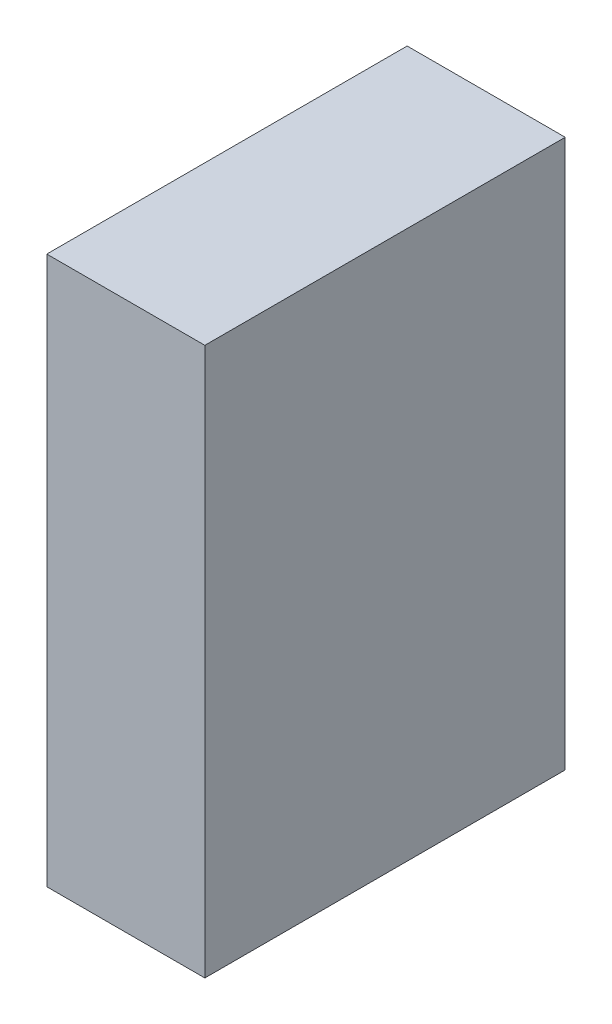
ISO-10303-21;
HEADER;
FILE_DESCRIPTION(('STEP AP214'),'2;1');
FILE_NAME('part.step','',(''),(''),'','','');
FILE_SCHEMA(('AUTOMOTIVE_DESIGN { 1 0 10303 214 1 1 1 1 }'));
ENDSEC;
DATA;
#1=APPLICATION_CONTEXT('core data for automotive mechanical design processes');
#2=APPLICATION_PROTOCOL_DEFINITION('international standard','automotive_design',2000,#1);
#3=PRODUCT_CONTEXT('',#1,'mechanical');
#4=PRODUCT('Part','Part','',(#3));
#5=PRODUCT_RELATED_PRODUCT_CATEGORY('part','',(#4));
#6=PRODUCT_DEFINITION_FORMATION('','',#4);
#7=PRODUCT_DEFINITION_CONTEXT('part definition',#1,'design');
#8=PRODUCT_DEFINITION('design','',#6,#7);
#9=PRODUCT_DEFINITION_SHAPE('','',#8);
#10=(LENGTH_UNIT() NAMED_UNIT(*) SI_UNIT(.MILLI.,.METRE.));
#11=(NAMED_UNIT(*) PLANE_ANGLE_UNIT() SI_UNIT($,.RADIAN.));
#12=(NAMED_UNIT(*) SI_UNIT($,.STERADIAN.) SOLID_ANGLE_UNIT());
#13=UNCERTAINTY_MEASURE_WITH_UNIT(LENGTH_MEASURE(1.E-05),#10,'distance_accuracy_value','');
#14=(GEOMETRIC_REPRESENTATION_CONTEXT(3) GLOBAL_UNCERTAINTY_ASSIGNED_CONTEXT((#13)) GLOBAL_UNIT_ASSIGNED_CONTEXT((#10,
#11,#12)) REPRESENTATION_CONTEXT('',''));
#15=CARTESIAN_POINT('',(0.,0.,0.));
#16=DIRECTION('',(0.,0.,1.));
#17=DIRECTION('',(1.,0.,0.));
#18=AXIS2_PLACEMENT_3D('',#15,#16,#17);
#19=CARTESIAN_POINT('',(0.18750026,0.65000124,0.));
#20=DIRECTION('',(1.,0.,0.));
#21=DIRECTION('',(0.,0.,-1.));
#22=AXIS2_PLACEMENT_3D('',#19,#20,#21);
#23=PLANE('',#22);
#24=DIRECTION('',(0.,0.,-1.));
#25=VECTOR('',#24,1.);
#26=CARTESIAN_POINT('',(0.18750026,-0.65000124,0.));
#27=LINE('',#26,#25);
#28=CARTESIAN_POINT('',(0.18750026,-0.65000124,0.));
#29=VERTEX_POINT('',#28);
#30=CARTESIAN_POINT('',(0.18750026,-0.65000124,0.85499956));
#31=VERTEX_POINT('',#30);
#32=EDGE_CURVE('E20',#29,#31,#27,.F.);
#33=ORIENTED_EDGE('',*,*,#32,.F.);
#34=DIRECTION('',(0.,1.,0.));
#35=VECTOR('',#34,1.);
#36=CARTESIAN_POINT('',(0.18750026,-0.65000124,0.));
#37=LINE('',#36,#35);
#38=CARTESIAN_POINT('',(0.18750026,0.65000124,0.));
#39=VERTEX_POINT('',#38);
#40=EDGE_CURVE('E80',#29,#39,#37,.T.);
#41=ORIENTED_EDGE('',*,*,#40,.T.);
#42=DIRECTION('',(0.,0.,1.));
#43=VECTOR('',#42,1.);
#44=CARTESIAN_POINT('',(0.18750026,0.65000124,0.));
#45=LINE('',#44,#43);
#46=CARTESIAN_POINT('',(0.18750026,0.65000124,0.85499956));
#47=VERTEX_POINT('',#46);
#48=EDGE_CURVE('E68',#47,#39,#45,.F.);
#49=ORIENTED_EDGE('',*,*,#48,.F.);
#50=DIRECTION('',(0.,1.,0.));
#51=VECTOR('',#50,1.);
#52=CARTESIAN_POINT('',(0.18750026,-0.65000124,0.85499956));
#53=LINE('',#52,#51);
#54=EDGE_CURVE('E56',#31,#47,#53,.T.);
#55=ORIENTED_EDGE('',*,*,#54,.F.);
#56=EDGE_LOOP('',(#33,#41,#49,#55));
#57=FACE_BOUND('',#56,.T.);
#58=ADVANCED_FACE('F17',(#57),#23,.T.);
#59=CARTESIAN_POINT('',(0.18750026,-0.65000124,0.));
#60=DIRECTION('',(0.,-1.,0.));
#61=DIRECTION('',(0.,0.,-1.));
#62=AXIS2_PLACEMENT_3D('',#59,#60,#61);
#63=PLANE('',#62);
#64=DIRECTION('',(0.,0.,1.));
#65=VECTOR('',#64,1.);
#66=CARTESIAN_POINT('',(-0.18750026,-0.65000124,0.));
#67=LINE('',#66,#65);
#68=CARTESIAN_POINT('',(-0.18750026,-0.65000124,0.));
#69=VERTEX_POINT('',#68);
#70=CARTESIAN_POINT('',(-0.18750026,-0.65000124,0.85499956));
#71=VERTEX_POINT('',#70);
#72=EDGE_CURVE('E83',#69,#71,#67,.T.);
#73=ORIENTED_EDGE('',*,*,#72,.F.);
#74=DIRECTION('',(1.,0.,0.));
#75=VECTOR('',#74,1.);
#76=CARTESIAN_POINT('',(-0.18750026,-0.65000124,0.));
#77=LINE('',#76,#75);
#78=EDGE_CURVE('E65',#69,#29,#77,.T.);
#79=ORIENTED_EDGE('',*,*,#78,.T.);
#80=ORIENTED_EDGE('',*,*,#32,.T.);
#81=DIRECTION('',(1.,0.,0.));
#82=VECTOR('',#81,1.);
#83=CARTESIAN_POINT('',(-0.18750026,-0.65000124,0.85499956));
#84=LINE('',#83,#82);
#85=EDGE_CURVE('E62',#71,#31,#84,.T.);
#86=ORIENTED_EDGE('',*,*,#85,.F.);
#87=EDGE_LOOP('',(#73,#79,#80,#86));
#88=FACE_BOUND('',#87,.T.);
#89=ADVANCED_FACE('F61',(#88),#63,.T.);
#90=CARTESIAN_POINT('',(-0.18750026,-0.65000124,0.85499956));
#91=DIRECTION('',(0.,0.,1.));
#92=DIRECTION('',(1.,0.,0.));
#93=AXIS2_PLACEMENT_3D('',#90,#91,#92);
#94=PLANE('',#93);
#95=DIRECTION('',(1.,0.,0.));
#96=VECTOR('',#95,1.);
#97=CARTESIAN_POINT('',(-0.18750026,0.65000124,0.85499956));
#98=LINE('',#97,#96);
#99=CARTESIAN_POINT('',(-0.18750026,0.65000124,0.85499956));
#100=VERTEX_POINT('',#99);
#101=EDGE_CURVE('E70',#100,#47,#98,.T.);
#102=ORIENTED_EDGE('',*,*,#101,.F.);
#103=DIRECTION('',(0.,1.,0.));
#104=VECTOR('',#103,1.);
#105=CARTESIAN_POINT('',(-0.18750026,-0.65000124,0.85499956));
#106=LINE('',#105,#104);
#107=EDGE_CURVE('E74',#71,#100,#106,.T.);
#108=ORIENTED_EDGE('',*,*,#107,.F.);
#109=ORIENTED_EDGE('',*,*,#85,.T.);
#110=ORIENTED_EDGE('',*,*,#54,.T.);
#111=EDGE_LOOP('',(#102,#108,#109,#110));
#112=FACE_BOUND('',#111,.T.);
#113=ADVANCED_FACE('F72',(#112),#94,.T.);
#114=CARTESIAN_POINT('',(-0.18750026,0.65000124,0.));
#115=DIRECTION('',(0.,1.,0.));
#116=DIRECTION('',(0.,0.,1.));
#117=AXIS2_PLACEMENT_3D('',#114,#115,#116);
#118=PLANE('',#117);
#119=ORIENTED_EDGE('',*,*,#48,.T.);
#120=DIRECTION('',(1.,0.,0.));
#121=VECTOR('',#120,1.);
#122=CARTESIAN_POINT('',(-0.18750026,0.65000124,0.));
#123=LINE('',#122,#121);
#124=CARTESIAN_POINT('',(-0.18750026,0.65000124,0.));
#125=VERTEX_POINT('',#124);
#126=EDGE_CURVE('E35',#39,#125,#123,.F.);
#127=ORIENTED_EDGE('',*,*,#126,.T.);
#128=DIRECTION('',(0.,0.,1.));
#129=VECTOR('',#128,1.);
#130=CARTESIAN_POINT('',(-0.18750026,0.65000124,0.));
#131=LINE('',#130,#129);
#132=EDGE_CURVE('E26',#100,#125,#131,.F.);
#133=ORIENTED_EDGE('',*,*,#132,.F.);
#134=ORIENTED_EDGE('',*,*,#101,.T.);
#135=EDGE_LOOP('',(#119,#127,#133,#134));
#136=FACE_BOUND('',#135,.T.);
#137=ADVANCED_FACE('F89',(#136),#118,.T.);
#138=CARTESIAN_POINT('',(-0.18750026,-0.65000124,0.));
#139=DIRECTION('',(0.,0.,1.));
#140=DIRECTION('',(1.,0.,0.));
#141=AXIS2_PLACEMENT_3D('',#138,#139,#140);
#142=PLANE('',#141);
#143=ORIENTED_EDGE('',*,*,#126,.F.);
#144=ORIENTED_EDGE('',*,*,#40,.F.);
#145=ORIENTED_EDGE('',*,*,#78,.F.);
#146=DIRECTION('',(0.,1.,0.));
#147=VECTOR('',#146,1.);
#148=CARTESIAN_POINT('',(-0.18750026,-0.65000124,0.));
#149=LINE('',#148,#147);
#150=EDGE_CURVE('E11',#125,#69,#149,.F.);
#151=ORIENTED_EDGE('',*,*,#150,.F.);
#152=EDGE_LOOP('',(#143,#144,#145,#151));
#153=FACE_BOUND('',#152,.T.);
#154=ADVANCED_FACE('F91',(#153),#142,.F.);
#155=CARTESIAN_POINT('',(-0.18750026,-0.65000124,0.));
#156=DIRECTION('',(-1.,0.,0.));
#157=DIRECTION('',(0.,0.,1.));
#158=AXIS2_PLACEMENT_3D('',#155,#156,#157);
#159=PLANE('',#158);
#160=ORIENTED_EDGE('',*,*,#132,.T.);
#161=ORIENTED_EDGE('',*,*,#150,.T.);
#162=ORIENTED_EDGE('',*,*,#72,.T.);
#163=ORIENTED_EDGE('',*,*,#107,.T.);
#164=EDGE_LOOP('',(#160,#161,#162,#163));
#165=FACE_BOUND('',#164,.T.);
#166=ADVANCED_FACE('F88',(#165),#159,.T.);
#167=CLOSED_SHELL('',(#58,#89,#113,#137,#154,#166));
#168=MANIFOLD_SOLID_BREP('B1',#167);
#169=ADVANCED_BREP_SHAPE_REPRESENTATION('',(#18,#168),#14);
#170=SHAPE_DEFINITION_REPRESENTATION(#9,#169);
ENDSEC;
END-ISO-10303-21;
